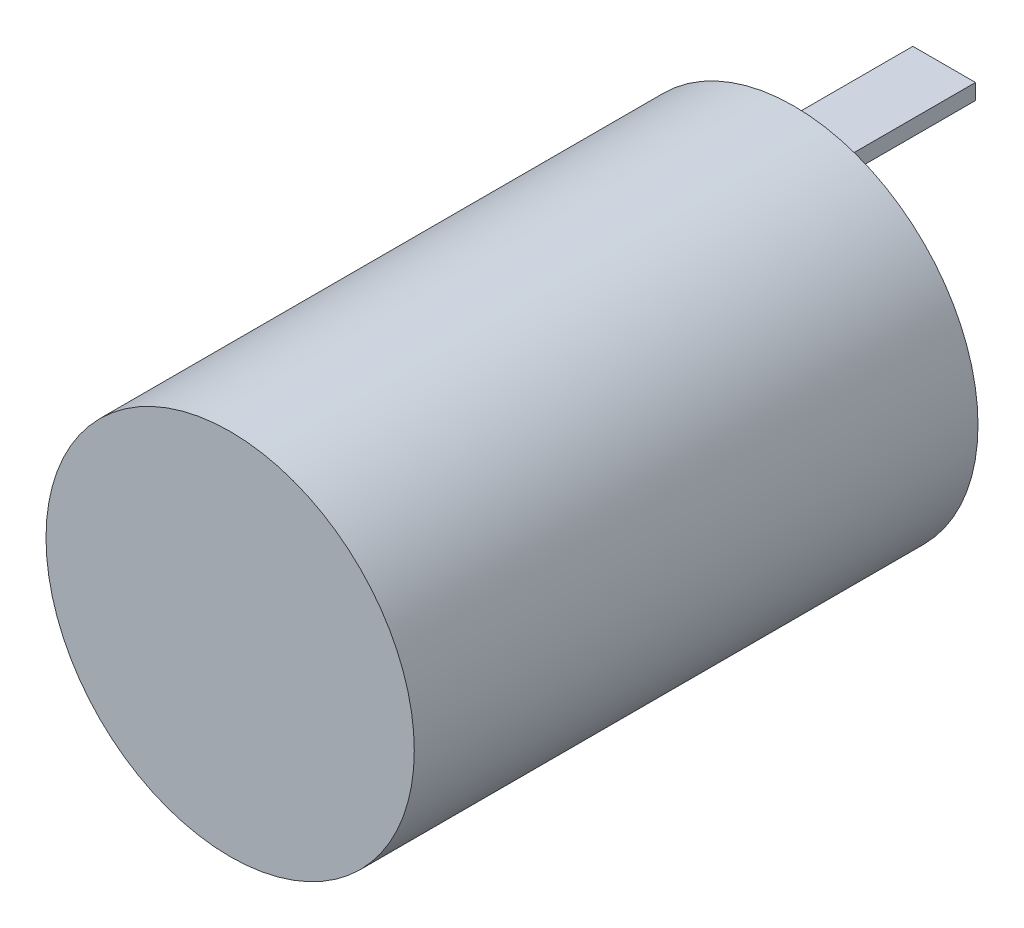
ISO-10303-21;
HEADER;
FILE_DESCRIPTION(('STEP AP214'),'2;1');
FILE_NAME('part.step','',(''),(''),'','','');
FILE_SCHEMA(('AUTOMOTIVE_DESIGN { 1 0 10303 214 1 1 1 1 }'));
ENDSEC;
DATA;
#1=APPLICATION_CONTEXT('core data for automotive mechanical design processes');
#2=APPLICATION_PROTOCOL_DEFINITION('international standard','automotive_design',2000,#1);
#3=PRODUCT_CONTEXT('',#1,'mechanical');
#4=PRODUCT('Part','Part','',(#3));
#5=PRODUCT_RELATED_PRODUCT_CATEGORY('part','',(#4));
#6=PRODUCT_DEFINITION_FORMATION('','',#4);
#7=PRODUCT_DEFINITION_CONTEXT('part definition',#1,'design');
#8=PRODUCT_DEFINITION('design','',#6,#7);
#9=PRODUCT_DEFINITION_SHAPE('','',#8);
#10=(LENGTH_UNIT() NAMED_UNIT(*) SI_UNIT(.MILLI.,.METRE.));
#11=(NAMED_UNIT(*) PLANE_ANGLE_UNIT() SI_UNIT($,.RADIAN.));
#12=(NAMED_UNIT(*) SI_UNIT($,.STERADIAN.) SOLID_ANGLE_UNIT());
#13=UNCERTAINTY_MEASURE_WITH_UNIT(LENGTH_MEASURE(1.E-05),#10,'distance_accuracy_value','');
#14=(GEOMETRIC_REPRESENTATION_CONTEXT(3) GLOBAL_UNCERTAINTY_ASSIGNED_CONTEXT((#13)) GLOBAL_UNIT_ASSIGNED_CONTEXT((#10,
#11,#12)) REPRESENTATION_CONTEXT('',''));
#15=CARTESIAN_POINT('',(0.,0.,0.));
#16=DIRECTION('',(0.,0.,1.));
#17=DIRECTION('',(1.,0.,0.));
#18=AXIS2_PLACEMENT_3D('',#15,#16,#17);
#19=CARTESIAN_POINT('',(0.,0.,57.15));
#20=DIRECTION('',(0.,0.,-1.));
#21=DIRECTION('',(-1.,0.,0.));
#22=AXIS2_PLACEMENT_3D('',#19,#20,#21);
#23=CYLINDRICAL_SURFACE('',#22,18.669);
#24=CARTESIAN_POINT('',(0.,0.,57.15));
#25=DIRECTION('',(0.,0.,1.));
#26=DIRECTION('',(1.,0.,0.));
#27=AXIS2_PLACEMENT_3D('',#24,#25,#26);
#28=CIRCLE('',#27,18.669);
#29=CARTESIAN_POINT('',(18.669,0.,57.15));
#30=VERTEX_POINT('',#29);
#31=EDGE_CURVE('E11',#30,#30,#28,.T.);
#32=ORIENTED_EDGE('',*,*,#31,.F.);
#33=EDGE_LOOP('',(#32));
#34=FACE_BOUND('',#33,.T.);
#35=CARTESIAN_POINT('',(0.,0.,0.));
#36=DIRECTION('',(0.,0.,1.));
#37=DIRECTION('',(1.,0.,0.));
#38=AXIS2_PLACEMENT_3D('',#35,#36,#37);
#39=CIRCLE('',#38,18.669);
#40=CARTESIAN_POINT('',(18.669,0.,0.));
#41=VERTEX_POINT('',#40);
#42=EDGE_CURVE('E38',#41,#41,#39,.T.);
#43=ORIENTED_EDGE('',*,*,#42,.T.);
#44=EDGE_LOOP('',(#43));
#45=FACE_BOUND('',#44,.T.);
#46=ADVANCED_FACE('F35',(#34,#45),#23,.T.);
#47=CARTESIAN_POINT('',(0.,0.,57.15));
#48=DIRECTION('',(0.,0.,1.));
#49=DIRECTION('',(1.,0.,0.));
#50=AXIS2_PLACEMENT_3D('',#47,#48,#49);
#51=PLANE('',#50);
#52=ORIENTED_EDGE('',*,*,#31,.T.);
#53=EDGE_LOOP('',(#52));
#54=FACE_BOUND('',#53,.T.);
#55=ADVANCED_FACE('F176',(#54),#51,.T.);
#56=CARTESIAN_POINT('',(0.,0.,0.));
#57=DIRECTION('',(0.,0.,1.));
#58=DIRECTION('',(1.,0.,0.));
#59=AXIS2_PLACEMENT_3D('',#56,#57,#58);
#60=PLANE('',#59);
#61=DIRECTION('',(-1.,0.,0.));
#62=VECTOR('',#61,1.);
#63=CARTESIAN_POINT('',(0.,-13.11275,0.));
#64=LINE('',#63,#62);
#65=CARTESIAN_POINT('',(3.175,-13.11275,0.));
#66=VERTEX_POINT('',#65);
#67=CARTESIAN_POINT('',(-3.175,-13.11275,0.));
#68=VERTEX_POINT('',#67);
#69=EDGE_CURVE('E49',#66,#68,#64,.T.);
#70=ORIENTED_EDGE('',*,*,#69,.T.);
#71=DIRECTION('',(0.,-1.,0.));
#72=VECTOR('',#71,1.);
#73=CARTESIAN_POINT('',(-3.175,0.,0.));
#74=LINE('',#73,#72);
#75=CARTESIAN_POINT('',(-3.175,-14.70025,0.));
#76=VERTEX_POINT('',#75);
#77=EDGE_CURVE('E103',#68,#76,#74,.T.);
#78=ORIENTED_EDGE('',*,*,#77,.T.);
#79=DIRECTION('',(-1.,0.,0.));
#80=VECTOR('',#79,1.);
#81=CARTESIAN_POINT('',(0.,-14.70025,0.));
#82=LINE('',#81,#80);
#83=CARTESIAN_POINT('',(3.175,-14.70025,0.));
#84=VERTEX_POINT('',#83);
#85=EDGE_CURVE('E116',#84,#76,#82,.T.);
#86=ORIENTED_EDGE('',*,*,#85,.F.);
#87=DIRECTION('',(0.,-1.,0.));
#88=VECTOR('',#87,1.);
#89=CARTESIAN_POINT('',(3.175,0.,0.));
#90=LINE('',#89,#88);
#91=EDGE_CURVE('E54',#66,#84,#90,.T.);
#92=ORIENTED_EDGE('',*,*,#91,.F.);
#93=EDGE_LOOP('',(#70,#78,#86,#92));
#94=FACE_BOUND('',#93,.T.);
#95=DIRECTION('',(-1.,0.,0.));
#96=VECTOR('',#95,1.);
#97=CARTESIAN_POINT('',(0.,14.70025,0.));
#98=LINE('',#97,#96);
#99=CARTESIAN_POINT('',(3.175,14.70025,0.));
#100=VERTEX_POINT('',#99);
#101=CARTESIAN_POINT('',(-3.175,14.70025,0.));
#102=VERTEX_POINT('',#101);
#103=EDGE_CURVE('E149',#100,#102,#98,.T.);
#104=ORIENTED_EDGE('',*,*,#103,.T.);
#105=DIRECTION('',(0.,-1.,0.));
#106=VECTOR('',#105,1.);
#107=CARTESIAN_POINT('',(-3.175,0.,0.));
#108=LINE('',#107,#106);
#109=CARTESIAN_POINT('',(-3.175,13.11275,0.));
#110=VERTEX_POINT('',#109);
#111=EDGE_CURVE('E106',#102,#110,#108,.T.);
#112=ORIENTED_EDGE('',*,*,#111,.T.);
#113=DIRECTION('',(-1.,0.,0.));
#114=VECTOR('',#113,1.);
#115=CARTESIAN_POINT('',(0.,13.11275,0.));
#116=LINE('',#115,#114);
#117=CARTESIAN_POINT('',(3.175,13.11275,0.));
#118=VERTEX_POINT('',#117);
#119=EDGE_CURVE('E140',#118,#110,#116,.T.);
#120=ORIENTED_EDGE('',*,*,#119,.F.);
#121=DIRECTION('',(0.,-1.,0.));
#122=VECTOR('',#121,1.);
#123=CARTESIAN_POINT('',(3.175,0.,0.));
#124=LINE('',#123,#122);
#125=EDGE_CURVE('E151',#100,#118,#124,.T.);
#126=ORIENTED_EDGE('',*,*,#125,.F.);
#127=EDGE_LOOP('',(#104,#112,#120,#126));
#128=FACE_BOUND('',#127,.T.);
#129=ORIENTED_EDGE('',*,*,#42,.F.);
#130=EDGE_LOOP('',(#129));
#131=FACE_BOUND('',#130,.T.);
#132=ADVANCED_FACE('F173',(#94,#128,#131),#60,.F.);
#133=CARTESIAN_POINT('',(-3.175,0.,-15.24));
#134=DIRECTION('',(-1.,0.,0.));
#135=DIRECTION('',(0.,-1.,0.));
#136=AXIS2_PLACEMENT_3D('',#133,#134,#135);
#137=PLANE('',#136);
#138=ORIENTED_EDGE('',*,*,#111,.F.);
#139=DIRECTION('',(0.,0.,1.));
#140=VECTOR('',#139,1.);
#141=CARTESIAN_POINT('',(-3.175,14.70025,-15.24));
#142=LINE('',#141,#140);
#143=CARTESIAN_POINT('',(-3.175,14.70025,-15.24));
#144=VERTEX_POINT('',#143);
#145=EDGE_CURVE('E164',#144,#102,#142,.T.);
#146=ORIENTED_EDGE('',*,*,#145,.F.);
#147=DIRECTION('',(0.,-1.,0.));
#148=VECTOR('',#147,1.);
#149=CARTESIAN_POINT('',(-3.175,0.,-15.24));
#150=LINE('',#149,#148);
#151=CARTESIAN_POINT('',(-3.175,13.11275,-15.24));
#152=VERTEX_POINT('',#151);
#153=EDGE_CURVE('E136',#144,#152,#150,.T.);
#154=ORIENTED_EDGE('',*,*,#153,.T.);
#155=DIRECTION('',(0.,0.,1.));
#156=VECTOR('',#155,1.);
#157=CARTESIAN_POINT('',(-3.175,13.11275,-15.24));
#158=LINE('',#157,#156);
#159=EDGE_CURVE('E147',#152,#110,#158,.T.);
#160=ORIENTED_EDGE('',*,*,#159,.T.);
#161=EDGE_LOOP('',(#138,#146,#154,#160));
#162=FACE_BOUND('',#161,.T.);
#163=ADVANCED_FACE('F175',(#162),#137,.T.);
#164=CARTESIAN_POINT('',(0.,14.70025,-15.24));
#165=DIRECTION('',(0.,1.,0.));
#166=DIRECTION('',(0.,0.,1.));
#167=AXIS2_PLACEMENT_3D('',#164,#165,#166);
#168=PLANE('',#167);
#169=ORIENTED_EDGE('',*,*,#103,.F.);
#170=DIRECTION('',(0.,0.,1.));
#171=VECTOR('',#170,1.);
#172=CARTESIAN_POINT('',(3.175,14.70025,-15.24));
#173=LINE('',#172,#171);
#174=CARTESIAN_POINT('',(3.175,14.70025,-15.24));
#175=VERTEX_POINT('',#174);
#176=EDGE_CURVE('E161',#175,#100,#173,.T.);
#177=ORIENTED_EDGE('',*,*,#176,.F.);
#178=DIRECTION('',(-1.,0.,0.));
#179=VECTOR('',#178,1.);
#180=CARTESIAN_POINT('',(0.,14.70025,-15.24));
#181=LINE('',#180,#179);
#182=EDGE_CURVE('E139',#175,#144,#181,.T.);
#183=ORIENTED_EDGE('',*,*,#182,.T.);
#184=ORIENTED_EDGE('',*,*,#145,.T.);
#185=EDGE_LOOP('',(#169,#177,#183,#184));
#186=FACE_BOUND('',#185,.T.);
#187=ADVANCED_FACE('F181',(#186),#168,.T.);
#188=CARTESIAN_POINT('',(3.175,0.,-15.24));
#189=DIRECTION('',(-1.,0.,0.));
#190=DIRECTION('',(0.,-1.,0.));
#191=AXIS2_PLACEMENT_3D('',#188,#189,#190);
#192=PLANE('',#191);
#193=ORIENTED_EDGE('',*,*,#125,.T.);
#194=DIRECTION('',(0.,0.,1.));
#195=VECTOR('',#194,1.);
#196=CARTESIAN_POINT('',(3.175,13.11275,-15.24));
#197=LINE('',#196,#195);
#198=CARTESIAN_POINT('',(3.175,13.11275,-15.24));
#199=VERTEX_POINT('',#198);
#200=EDGE_CURVE('E158',#199,#118,#197,.T.);
#201=ORIENTED_EDGE('',*,*,#200,.F.);
#202=DIRECTION('',(0.,-1.,0.));
#203=VECTOR('',#202,1.);
#204=CARTESIAN_POINT('',(3.175,0.,-15.24));
#205=LINE('',#204,#203);
#206=EDGE_CURVE('E143',#175,#199,#205,.T.);
#207=ORIENTED_EDGE('',*,*,#206,.F.);
#208=ORIENTED_EDGE('',*,*,#176,.T.);
#209=EDGE_LOOP('',(#193,#201,#207,#208));
#210=FACE_BOUND('',#209,.T.);
#211=ADVANCED_FACE('F215',(#210),#192,.F.);
#212=CARTESIAN_POINT('',(0.,13.11275,-15.24));
#213=DIRECTION('',(0.,1.,0.));
#214=DIRECTION('',(0.,0.,1.));
#215=AXIS2_PLACEMENT_3D('',#212,#213,#214);
#216=PLANE('',#215);
#217=ORIENTED_EDGE('',*,*,#119,.T.);
#218=ORIENTED_EDGE('',*,*,#159,.F.);
#219=DIRECTION('',(-1.,0.,0.));
#220=VECTOR('',#219,1.);
#221=CARTESIAN_POINT('',(0.,13.11275,-15.24));
#222=LINE('',#221,#220);
#223=EDGE_CURVE('E145',#199,#152,#222,.T.);
#224=ORIENTED_EDGE('',*,*,#223,.F.);
#225=ORIENTED_EDGE('',*,*,#200,.T.);
#226=EDGE_LOOP('',(#217,#218,#224,#225));
#227=FACE_BOUND('',#226,.T.);
#228=ADVANCED_FACE('F224',(#227),#216,.F.);
#229=CARTESIAN_POINT('',(0.,0.,-15.24));
#230=DIRECTION('',(0.,0.,-1.));
#231=DIRECTION('',(-1.,0.,0.));
#232=AXIS2_PLACEMENT_3D('',#229,#230,#231);
#233=PLANE('',#232);
#234=ORIENTED_EDGE('',*,*,#153,.F.);
#235=ORIENTED_EDGE('',*,*,#182,.F.);
#236=ORIENTED_EDGE('',*,*,#206,.T.);
#237=ORIENTED_EDGE('',*,*,#223,.T.);
#238=EDGE_LOOP('',(#234,#235,#236,#237));
#239=FACE_BOUND('',#238,.T.);
#240=ADVANCED_FACE('F234',(#239),#233,.T.);
#241=CARTESIAN_POINT('',(-3.175,0.,-15.24));
#242=DIRECTION('',(-1.,0.,0.));
#243=DIRECTION('',(0.,0.,1.));
#244=AXIS2_PLACEMENT_3D('',#241,#242,#243);
#245=PLANE('',#244);
#246=ORIENTED_EDGE('',*,*,#77,.F.);
#247=DIRECTION('',(0.,0.,1.));
#248=VECTOR('',#247,1.);
#249=CARTESIAN_POINT('',(-3.175,-13.11275,-15.24));
#250=LINE('',#249,#248);
#251=CARTESIAN_POINT('',(-3.175,-13.11275,-15.24));
#252=VERTEX_POINT('',#251);
#253=EDGE_CURVE('E98',#252,#68,#250,.T.);
#254=ORIENTED_EDGE('',*,*,#253,.F.);
#255=DIRECTION('',(0.,-1.,0.));
#256=VECTOR('',#255,1.);
#257=CARTESIAN_POINT('',(-3.175,0.,-15.24));
#258=LINE('',#257,#256);
#259=CARTESIAN_POINT('',(-3.175,-14.70025,-15.24));
#260=VERTEX_POINT('',#259);
#261=EDGE_CURVE('E102',#252,#260,#258,.T.);
#262=ORIENTED_EDGE('',*,*,#261,.T.);
#263=DIRECTION('',(0.,0.,1.));
#264=VECTOR('',#263,1.);
#265=CARTESIAN_POINT('',(-3.175,-14.70025,-15.24));
#266=LINE('',#265,#264);
#267=EDGE_CURVE('E125',#260,#76,#266,.T.);
#268=ORIENTED_EDGE('',*,*,#267,.T.);
#269=EDGE_LOOP('',(#246,#254,#262,#268));
#270=FACE_BOUND('',#269,.T.);
#271=ADVANCED_FACE('F100',(#270),#245,.T.);
#272=CARTESIAN_POINT('',(0.,-13.11275,-15.24));
#273=DIRECTION('',(0.,1.,0.));
#274=DIRECTION('',(0.,0.,1.));
#275=AXIS2_PLACEMENT_3D('',#272,#273,#274);
#276=PLANE('',#275);
#277=ORIENTED_EDGE('',*,*,#69,.F.);
#278=DIRECTION('',(0.,0.,1.));
#279=VECTOR('',#278,1.);
#280=CARTESIAN_POINT('',(3.175,-13.11275,-15.24));
#281=LINE('',#280,#279);
#282=CARTESIAN_POINT('',(3.175,-13.11275,-15.24));
#283=VERTEX_POINT('',#282);
#284=EDGE_CURVE('E107',#283,#66,#281,.T.);
#285=ORIENTED_EDGE('',*,*,#284,.F.);
#286=DIRECTION('',(-1.,0.,0.));
#287=VECTOR('',#286,1.);
#288=CARTESIAN_POINT('',(0.,-13.11275,-15.24));
#289=LINE('',#288,#287);
#290=EDGE_CURVE('E112',#283,#252,#289,.T.);
#291=ORIENTED_EDGE('',*,*,#290,.T.);
#292=ORIENTED_EDGE('',*,*,#253,.T.);
#293=EDGE_LOOP('',(#277,#285,#291,#292));
#294=FACE_BOUND('',#293,.T.);
#295=ADVANCED_FACE('F118',(#294),#276,.T.);
#296=CARTESIAN_POINT('',(3.175,0.,-15.24));
#297=DIRECTION('',(-1.,0.,0.));
#298=DIRECTION('',(0.,0.,1.));
#299=AXIS2_PLACEMENT_3D('',#296,#297,#298);
#300=PLANE('',#299);
#301=ORIENTED_EDGE('',*,*,#91,.T.);
#302=DIRECTION('',(0.,0.,1.));
#303=VECTOR('',#302,1.);
#304=CARTESIAN_POINT('',(3.175,-14.70025,-15.24));
#305=LINE('',#304,#303);
#306=CARTESIAN_POINT('',(3.175,-14.70025,-15.24));
#307=VERTEX_POINT('',#306);
#308=EDGE_CURVE('E132',#307,#84,#305,.T.);
#309=ORIENTED_EDGE('',*,*,#308,.F.);
#310=DIRECTION('',(0.,-1.,0.));
#311=VECTOR('',#310,1.);
#312=CARTESIAN_POINT('',(3.175,0.,-15.24));
#313=LINE('',#312,#311);
#314=EDGE_CURVE('E120',#283,#307,#313,.T.);
#315=ORIENTED_EDGE('',*,*,#314,.F.);
#316=ORIENTED_EDGE('',*,*,#284,.T.);
#317=EDGE_LOOP('',(#301,#309,#315,#316));
#318=FACE_BOUND('',#317,.T.);
#319=ADVANCED_FACE('F261',(#318),#300,.F.);
#320=CARTESIAN_POINT('',(0.,-14.70025,-15.24));
#321=DIRECTION('',(0.,1.,0.));
#322=DIRECTION('',(0.,0.,1.));
#323=AXIS2_PLACEMENT_3D('',#320,#321,#322);
#324=PLANE('',#323);
#325=ORIENTED_EDGE('',*,*,#85,.T.);
#326=ORIENTED_EDGE('',*,*,#267,.F.);
#327=DIRECTION('',(-1.,0.,0.));
#328=VECTOR('',#327,1.);
#329=CARTESIAN_POINT('',(0.,-14.70025,-15.24));
#330=LINE('',#329,#328);
#331=EDGE_CURVE('E114',#307,#260,#330,.T.);
#332=ORIENTED_EDGE('',*,*,#331,.F.);
#333=ORIENTED_EDGE('',*,*,#308,.T.);
#334=EDGE_LOOP('',(#325,#326,#332,#333));
#335=FACE_BOUND('',#334,.T.);
#336=ADVANCED_FACE('F270',(#335),#324,.F.);
#337=CARTESIAN_POINT('',(0.,0.,-15.24));
#338=DIRECTION('',(0.,0.,-1.));
#339=DIRECTION('',(-1.,0.,0.));
#340=AXIS2_PLACEMENT_3D('',#337,#338,#339);
#341=PLANE('',#340);
#342=ORIENTED_EDGE('',*,*,#261,.F.);
#343=ORIENTED_EDGE('',*,*,#290,.F.);
#344=ORIENTED_EDGE('',*,*,#314,.T.);
#345=ORIENTED_EDGE('',*,*,#331,.T.);
#346=EDGE_LOOP('',(#342,#343,#344,#345));
#347=FACE_BOUND('',#346,.T.);
#348=ADVANCED_FACE('F111',(#347),#341,.T.);
#349=CLOSED_SHELL('',(#46,#55,#132,#163,#187,#211,#228,#240,#271,#295,#319,#336,#348));
#350=MANIFOLD_SOLID_BREP('B2',#349);
#351=ADVANCED_BREP_SHAPE_REPRESENTATION('',(#18,#350),#14);
#352=SHAPE_DEFINITION_REPRESENTATION(#9,#351);
ENDSEC;
END-ISO-10303-21;
